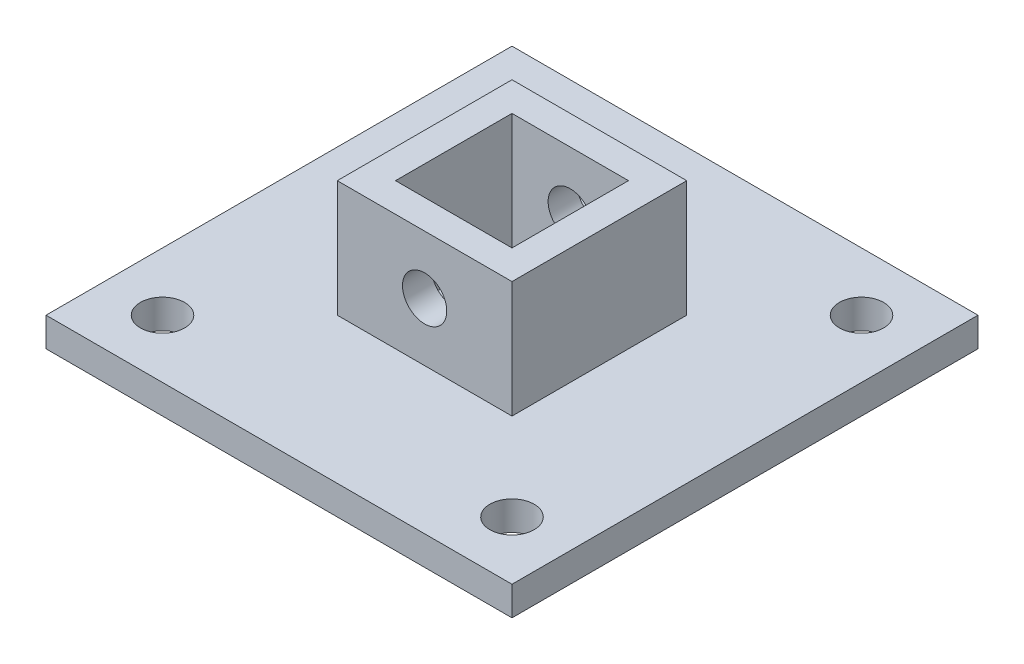
ISO-10303-21;
HEADER;
FILE_DESCRIPTION(('STEP AP214'),'2;1');
FILE_NAME('part.step','',(''),(''),'','','');
FILE_SCHEMA(('AUTOMOTIVE_DESIGN { 1 0 10303 214 1 1 1 1 }'));
ENDSEC;
DATA;
#1=APPLICATION_CONTEXT('core data for automotive mechanical design processes');
#2=APPLICATION_PROTOCOL_DEFINITION('international standard','automotive_design',2000,#1);
#3=PRODUCT_CONTEXT('',#1,'mechanical');
#4=PRODUCT('Part','Part','',(#3));
#5=PRODUCT_RELATED_PRODUCT_CATEGORY('part','',(#4));
#6=PRODUCT_DEFINITION_FORMATION('','',#4);
#7=PRODUCT_DEFINITION_CONTEXT('part definition',#1,'design');
#8=PRODUCT_DEFINITION('design','',#6,#7);
#9=PRODUCT_DEFINITION_SHAPE('','',#8);
#10=(LENGTH_UNIT() NAMED_UNIT(*) SI_UNIT(.MILLI.,.METRE.));
#11=(NAMED_UNIT(*) PLANE_ANGLE_UNIT() SI_UNIT($,.RADIAN.));
#12=(NAMED_UNIT(*) SI_UNIT($,.STERADIAN.) SOLID_ANGLE_UNIT());
#13=UNCERTAINTY_MEASURE_WITH_UNIT(LENGTH_MEASURE(1.E-05),#10,'distance_accuracy_value','');
#14=(GEOMETRIC_REPRESENTATION_CONTEXT(3) GLOBAL_UNCERTAINTY_ASSIGNED_CONTEXT((#13)) GLOBAL_UNIT_ASSIGNED_CONTEXT((#10,
#11,#12)) REPRESENTATION_CONTEXT('',''));
#15=CARTESIAN_POINT('',(0.,0.,0.));
#16=DIRECTION('',(0.,0.,1.));
#17=DIRECTION('',(1.,0.,0.));
#18=AXIS2_PLACEMENT_3D('',#15,#16,#17);
#19=CARTESIAN_POINT('',(0.,6.35,0.));
#20=DIRECTION('',(0.,1.,0.));
#21=DIRECTION('',(0.,0.,1.));
#22=AXIS2_PLACEMENT_3D('',#19,#20,#21);
#23=PLANE('',#22);
#24=CARTESIAN_POINT('',(-38.1,6.35,38.1));
#25=DIRECTION('',(0.,1.,0.));
#26=DIRECTION('',(0.,0.,1.));
#27=AXIS2_PLACEMENT_3D('',#24,#25,#26);
#28=CIRCLE('',#27,4.826);
#29=CARTESIAN_POINT('',(-38.1,6.35,42.926));
#30=VERTEX_POINT('',#29);
#31=EDGE_CURVE('E538',#30,#30,#28,.T.);
#32=ORIENTED_EDGE('',*,*,#31,.F.);
#33=EDGE_LOOP('',(#32));
#34=FACE_BOUND('',#33,.T.);
#35=CARTESIAN_POINT('',(38.1,6.35,38.1));
#36=DIRECTION('',(0.,1.,0.));
#37=DIRECTION('',(0.,0.,1.));
#38=AXIS2_PLACEMENT_3D('',#35,#36,#37);
#39=CIRCLE('',#38,4.826);
#40=CARTESIAN_POINT('',(38.1,6.35,42.926));
#41=VERTEX_POINT('',#40);
#42=EDGE_CURVE('E531',#41,#41,#39,.T.);
#43=ORIENTED_EDGE('',*,*,#42,.F.);
#44=EDGE_LOOP('',(#43));
#45=FACE_BOUND('',#44,.T.);
#46=CARTESIAN_POINT('',(38.1,6.35,-38.1));
#47=DIRECTION('',(0.,1.,0.));
#48=DIRECTION('',(0.,0.,1.));
#49=AXIS2_PLACEMENT_3D('',#46,#47,#48);
#50=CIRCLE('',#49,4.826);
#51=CARTESIAN_POINT('',(38.1,6.35,-33.274));
#52=VERTEX_POINT('',#51);
#53=EDGE_CURVE('E523',#52,#52,#50,.T.);
#54=ORIENTED_EDGE('',*,*,#53,.F.);
#55=EDGE_LOOP('',(#54));
#56=FACE_BOUND('',#55,.T.);
#57=CARTESIAN_POINT('',(-38.1,6.35,-38.1));
#58=DIRECTION('',(0.,1.,0.));
#59=DIRECTION('',(0.,0.,1.));
#60=AXIS2_PLACEMENT_3D('',#57,#58,#59);
#61=CIRCLE('',#60,4.826);
#62=CARTESIAN_POINT('',(-38.1,6.35,-33.274));
#63=VERTEX_POINT('',#62);
#64=EDGE_CURVE('E271',#63,#63,#61,.T.);
#65=ORIENTED_EDGE('',*,*,#64,.F.);
#66=EDGE_LOOP('',(#65));
#67=FACE_BOUND('',#66,.T.);
#68=DIRECTION('',(0.,0.,1.));
#69=VECTOR('',#68,1.);
#70=CARTESIAN_POINT('',(-50.8,6.35,50.8));
#71=LINE('',#70,#69);
#72=CARTESIAN_POINT('',(-50.8,6.35,-50.8));
#73=VERTEX_POINT('',#72);
#74=CARTESIAN_POINT('',(-50.8,6.35,50.8));
#75=VERTEX_POINT('',#74);
#76=EDGE_CURVE('E225',#73,#75,#71,.T.);
#77=ORIENTED_EDGE('',*,*,#76,.T.);
#78=DIRECTION('',(1.,0.,0.));
#79=VECTOR('',#78,1.);
#80=CARTESIAN_POINT('',(50.8,6.35,50.8));
#81=LINE('',#80,#79);
#82=CARTESIAN_POINT('',(50.8,6.35,50.8));
#83=VERTEX_POINT('',#82);
#84=EDGE_CURVE('E229',#75,#83,#81,.T.);
#85=ORIENTED_EDGE('',*,*,#84,.T.);
#86=DIRECTION('',(0.,0.,-1.));
#87=VECTOR('',#86,1.);
#88=CARTESIAN_POINT('',(50.8,6.35,50.8));
#89=LINE('',#88,#87);
#90=CARTESIAN_POINT('',(50.8,6.35,-50.8));
#91=VERTEX_POINT('',#90);
#92=EDGE_CURVE('E233',#83,#91,#89,.T.);
#93=ORIENTED_EDGE('',*,*,#92,.T.);
#94=DIRECTION('',(-1.,0.,0.));
#95=VECTOR('',#94,1.);
#96=CARTESIAN_POINT('',(50.8,6.35,-50.8));
#97=LINE('',#96,#95);
#98=EDGE_CURVE('E236',#91,#73,#97,.T.);
#99=ORIENTED_EDGE('',*,*,#98,.T.);
#100=EDGE_LOOP('',(#77,#85,#93,#99));
#101=FACE_BOUND('',#100,.T.);
#102=DIRECTION('',(-1.,0.,0.));
#103=VECTOR('',#102,1.);
#104=CARTESIAN_POINT('',(-19.05,6.35,-19.05));
#105=LINE('',#104,#103);
#106=CARTESIAN_POINT('',(19.05,6.35,-19.05));
#107=VERTEX_POINT('',#106);
#108=CARTESIAN_POINT('',(-19.05,6.35,-19.05));
#109=VERTEX_POINT('',#108);
#110=EDGE_CURVE('E204',#107,#109,#105,.T.);
#111=ORIENTED_EDGE('',*,*,#110,.F.);
#112=DIRECTION('',(0.,0.,-1.));
#113=VECTOR('',#112,1.);
#114=CARTESIAN_POINT('',(19.05,6.35,19.05));
#115=LINE('',#114,#113);
#116=CARTESIAN_POINT('',(19.05,6.35,19.05));
#117=VERTEX_POINT('',#116);
#118=EDGE_CURVE('E152',#117,#107,#115,.T.);
#119=ORIENTED_EDGE('',*,*,#118,.F.);
#120=DIRECTION('',(1.,0.,0.));
#121=VECTOR('',#120,1.);
#122=CARTESIAN_POINT('',(-19.05,6.35,19.05));
#123=LINE('',#122,#121);
#124=CARTESIAN_POINT('',(-19.05,6.35,19.05));
#125=VERTEX_POINT('',#124);
#126=EDGE_CURVE('E191',#125,#117,#123,.T.);
#127=ORIENTED_EDGE('',*,*,#126,.F.);
#128=DIRECTION('',(0.,0.,1.));
#129=VECTOR('',#128,1.);
#130=CARTESIAN_POINT('',(-19.05,6.35,19.05));
#131=LINE('',#130,#129);
#132=EDGE_CURVE('E207',#109,#125,#131,.T.);
#133=ORIENTED_EDGE('',*,*,#132,.F.);
#134=EDGE_LOOP('',(#111,#119,#127,#133));
#135=FACE_BOUND('',#134,.T.);
#136=ADVANCED_FACE('F39',(#34,#45,#56,#67,#101,#135),#23,.T.);
#137=CARTESIAN_POINT('',(-50.8,6.35,50.8));
#138=DIRECTION('',(1.,0.,0.));
#139=DIRECTION('',(0.,0.,-1.));
#140=AXIS2_PLACEMENT_3D('',#137,#138,#139);
#141=PLANE('',#140);
#142=DIRECTION('',(0.,0.,1.));
#143=VECTOR('',#142,1.);
#144=CARTESIAN_POINT('',(-50.8,0.,50.8));
#145=LINE('',#144,#143);
#146=CARTESIAN_POINT('',(-50.8,0.,-50.8));
#147=VERTEX_POINT('',#146);
#148=CARTESIAN_POINT('',(-50.8,0.,50.8));
#149=VERTEX_POINT('',#148);
#150=EDGE_CURVE('E224',#147,#149,#145,.T.);
#151=ORIENTED_EDGE('',*,*,#150,.T.);
#152=DIRECTION('',(0.,-1.,0.));
#153=VECTOR('',#152,1.);
#154=CARTESIAN_POINT('',(-50.8,6.35,50.8));
#155=LINE('',#154,#153);
#156=EDGE_CURVE('E11',#75,#149,#155,.T.);
#157=ORIENTED_EDGE('',*,*,#156,.F.);
#158=ORIENTED_EDGE('',*,*,#76,.F.);
#159=DIRECTION('',(0.,-1.,0.));
#160=VECTOR('',#159,1.);
#161=CARTESIAN_POINT('',(-50.8,6.35,-50.8));
#162=LINE('',#161,#160);
#163=EDGE_CURVE('E239',#73,#147,#162,.T.);
#164=ORIENTED_EDGE('',*,*,#163,.T.);
#165=EDGE_LOOP('',(#151,#157,#158,#164));
#166=FACE_BOUND('',#165,.T.);
#167=ADVANCED_FACE('F41',(#166),#141,.F.);
#168=CARTESIAN_POINT('',(50.8,6.35,50.8));
#169=DIRECTION('',(0.,0.,-1.));
#170=DIRECTION('',(-1.,0.,0.));
#171=AXIS2_PLACEMENT_3D('',#168,#169,#170);
#172=PLANE('',#171);
#173=DIRECTION('',(1.,0.,0.));
#174=VECTOR('',#173,1.);
#175=CARTESIAN_POINT('',(50.8,0.,50.8));
#176=LINE('',#175,#174);
#177=CARTESIAN_POINT('',(50.8,0.,50.8));
#178=VERTEX_POINT('',#177);
#179=EDGE_CURVE('E243',#149,#178,#176,.T.);
#180=ORIENTED_EDGE('',*,*,#179,.T.);
#181=DIRECTION('',(0.,-1.,0.));
#182=VECTOR('',#181,1.);
#183=CARTESIAN_POINT('',(50.8,6.35,50.8));
#184=LINE('',#183,#182);
#185=EDGE_CURVE('E49',#83,#178,#184,.T.);
#186=ORIENTED_EDGE('',*,*,#185,.F.);
#187=ORIENTED_EDGE('',*,*,#84,.F.);
#188=ORIENTED_EDGE('',*,*,#156,.T.);
#189=EDGE_LOOP('',(#180,#186,#187,#188));
#190=FACE_BOUND('',#189,.T.);
#191=ADVANCED_FACE('F305',(#190),#172,.F.);
#192=CARTESIAN_POINT('',(50.8,6.35,50.8));
#193=DIRECTION('',(-1.,0.,0.));
#194=DIRECTION('',(0.,0.,1.));
#195=AXIS2_PLACEMENT_3D('',#192,#193,#194);
#196=PLANE('',#195);
#197=DIRECTION('',(0.,0.,-1.));
#198=VECTOR('',#197,1.);
#199=CARTESIAN_POINT('',(50.8,0.,50.8));
#200=LINE('',#199,#198);
#201=CARTESIAN_POINT('',(50.8,0.,-50.8));
#202=VERTEX_POINT('',#201);
#203=EDGE_CURVE('E246',#178,#202,#200,.T.);
#204=ORIENTED_EDGE('',*,*,#203,.T.);
#205=DIRECTION('',(0.,-1.,0.));
#206=VECTOR('',#205,1.);
#207=CARTESIAN_POINT('',(50.8,6.35,-50.8));
#208=LINE('',#207,#206);
#209=EDGE_CURVE('E254',#91,#202,#208,.T.);
#210=ORIENTED_EDGE('',*,*,#209,.F.);
#211=ORIENTED_EDGE('',*,*,#92,.F.);
#212=ORIENTED_EDGE('',*,*,#185,.T.);
#213=EDGE_LOOP('',(#204,#210,#211,#212));
#214=FACE_BOUND('',#213,.T.);
#215=ADVANCED_FACE('F439',(#214),#196,.F.);
#216=CARTESIAN_POINT('',(50.8,6.35,-50.8));
#217=DIRECTION('',(0.,0.,1.));
#218=DIRECTION('',(1.,0.,0.));
#219=AXIS2_PLACEMENT_3D('',#216,#217,#218);
#220=PLANE('',#219);
#221=DIRECTION('',(-1.,0.,0.));
#222=VECTOR('',#221,1.);
#223=CARTESIAN_POINT('',(50.8,0.,-50.8));
#224=LINE('',#223,#222);
#225=EDGE_CURVE('E230',#202,#147,#224,.T.);
#226=ORIENTED_EDGE('',*,*,#225,.T.);
#227=ORIENTED_EDGE('',*,*,#163,.F.);
#228=ORIENTED_EDGE('',*,*,#98,.F.);
#229=ORIENTED_EDGE('',*,*,#209,.T.);
#230=EDGE_LOOP('',(#226,#227,#228,#229));
#231=FACE_BOUND('',#230,.T.);
#232=ADVANCED_FACE('F405',(#231),#220,.F.);
#233=CARTESIAN_POINT('',(0.,0.,0.));
#234=DIRECTION('',(0.,1.,0.));
#235=DIRECTION('',(0.,0.,1.));
#236=AXIS2_PLACEMENT_3D('',#233,#234,#235);
#237=PLANE('',#236);
#238=CARTESIAN_POINT('',(-38.1,0.,38.1));
#239=DIRECTION('',(0.,1.,0.));
#240=DIRECTION('',(0.,0.,1.));
#241=AXIS2_PLACEMENT_3D('',#238,#239,#240);
#242=CIRCLE('',#241,4.826);
#243=CARTESIAN_POINT('',(-38.1,0.,42.926));
#244=VERTEX_POINT('',#243);
#245=EDGE_CURVE('E43',#244,#244,#242,.T.);
#246=ORIENTED_EDGE('',*,*,#245,.T.);
#247=EDGE_LOOP('',(#246));
#248=FACE_BOUND('',#247,.T.);
#249=CARTESIAN_POINT('',(38.1,0.,38.1));
#250=DIRECTION('',(0.,1.,0.));
#251=DIRECTION('',(0.,0.,1.));
#252=AXIS2_PLACEMENT_3D('',#249,#250,#251);
#253=CIRCLE('',#252,4.826);
#254=CARTESIAN_POINT('',(38.1,0.,42.926));
#255=VERTEX_POINT('',#254);
#256=EDGE_CURVE('E274',#255,#255,#253,.T.);
#257=ORIENTED_EDGE('',*,*,#256,.T.);
#258=EDGE_LOOP('',(#257));
#259=FACE_BOUND('',#258,.T.);
#260=CARTESIAN_POINT('',(38.1,0.,-38.1));
#261=DIRECTION('',(0.,1.,0.));
#262=DIRECTION('',(0.,0.,1.));
#263=AXIS2_PLACEMENT_3D('',#260,#261,#262);
#264=CIRCLE('',#263,4.826);
#265=CARTESIAN_POINT('',(38.1,0.,-33.274));
#266=VERTEX_POINT('',#265);
#267=EDGE_CURVE('E270',#266,#266,#264,.T.);
#268=ORIENTED_EDGE('',*,*,#267,.T.);
#269=EDGE_LOOP('',(#268));
#270=FACE_BOUND('',#269,.T.);
#271=CARTESIAN_POINT('',(-38.1,0.,-38.1));
#272=DIRECTION('',(0.,1.,0.));
#273=DIRECTION('',(0.,0.,1.));
#274=AXIS2_PLACEMENT_3D('',#271,#272,#273);
#275=CIRCLE('',#274,4.826);
#276=CARTESIAN_POINT('',(-38.1,0.,-33.274));
#277=VERTEX_POINT('',#276);
#278=EDGE_CURVE('E266',#277,#277,#275,.T.);
#279=ORIENTED_EDGE('',*,*,#278,.T.);
#280=EDGE_LOOP('',(#279));
#281=FACE_BOUND('',#280,.T.);
#282=ORIENTED_EDGE('',*,*,#150,.F.);
#283=ORIENTED_EDGE('',*,*,#225,.F.);
#284=ORIENTED_EDGE('',*,*,#203,.F.);
#285=ORIENTED_EDGE('',*,*,#179,.F.);
#286=EDGE_LOOP('',(#282,#283,#284,#285));
#287=FACE_BOUND('',#286,.T.);
#288=ADVANCED_FACE('F283',(#248,#259,#270,#281,#287),#237,.F.);
#289=CARTESIAN_POINT('',(0.,31.75,0.));
#290=DIRECTION('',(0.,-1.,0.));
#291=DIRECTION('',(0.,0.,-1.));
#292=AXIS2_PLACEMENT_3D('',#289,#290,#291);
#293=PLANE('',#292);
#294=DIRECTION('',(0.,0.,-1.));
#295=VECTOR('',#294,1.);
#296=CARTESIAN_POINT('',(19.05,31.75,19.05));
#297=LINE('',#296,#295);
#298=CARTESIAN_POINT('',(19.05,31.75,19.05));
#299=VERTEX_POINT('',#298);
#300=CARTESIAN_POINT('',(19.05,31.75,-19.05));
#301=VERTEX_POINT('',#300);
#302=EDGE_CURVE('E186',#299,#301,#297,.T.);
#303=ORIENTED_EDGE('',*,*,#302,.T.);
#304=DIRECTION('',(-1.,0.,0.));
#305=VECTOR('',#304,1.);
#306=CARTESIAN_POINT('',(-19.05,31.75,-19.05));
#307=LINE('',#306,#305);
#308=CARTESIAN_POINT('',(-19.05,31.75,-19.05));
#309=VERTEX_POINT('',#308);
#310=EDGE_CURVE('E190',#301,#309,#307,.T.);
#311=ORIENTED_EDGE('',*,*,#310,.T.);
#312=DIRECTION('',(0.,0.,1.));
#313=VECTOR('',#312,1.);
#314=CARTESIAN_POINT('',(-19.05,31.75,19.05));
#315=LINE('',#314,#313);
#316=CARTESIAN_POINT('',(-19.05,31.75,19.05));
#317=VERTEX_POINT('',#316);
#318=EDGE_CURVE('E194',#309,#317,#315,.T.);
#319=ORIENTED_EDGE('',*,*,#318,.T.);
#320=DIRECTION('',(1.,0.,0.));
#321=VECTOR('',#320,1.);
#322=CARTESIAN_POINT('',(-19.05,31.75,19.05));
#323=LINE('',#322,#321);
#324=EDGE_CURVE('E197',#317,#299,#323,.T.);
#325=ORIENTED_EDGE('',*,*,#324,.T.);
#326=EDGE_LOOP('',(#303,#311,#319,#325));
#327=FACE_BOUND('',#326,.T.);
#328=DIRECTION('',(0.,0.,1.));
#329=VECTOR('',#328,1.);
#330=CARTESIAN_POINT('',(-12.7,31.75,12.7));
#331=LINE('',#330,#329);
#332=CARTESIAN_POINT('',(-12.7,31.75,-12.7));
#333=VERTEX_POINT('',#332);
#334=CARTESIAN_POINT('',(-12.7,31.75,12.7));
#335=VERTEX_POINT('',#334);
#336=EDGE_CURVE('E133',#333,#335,#331,.T.);
#337=ORIENTED_EDGE('',*,*,#336,.F.);
#338=DIRECTION('',(-1.,0.,0.));
#339=VECTOR('',#338,1.);
#340=CARTESIAN_POINT('',(12.7,31.75,-12.7));
#341=LINE('',#340,#339);
#342=CARTESIAN_POINT('',(12.7,31.75,-12.7));
#343=VERTEX_POINT('',#342);
#344=EDGE_CURVE('E162',#343,#333,#341,.T.);
#345=ORIENTED_EDGE('',*,*,#344,.F.);
#346=DIRECTION('',(0.,0.,-1.));
#347=VECTOR('',#346,1.);
#348=CARTESIAN_POINT('',(12.7,31.75,12.7));
#349=LINE('',#348,#347);
#350=CARTESIAN_POINT('',(12.7,31.75,12.7));
#351=VERTEX_POINT('',#350);
#352=EDGE_CURVE('E158',#351,#343,#349,.T.);
#353=ORIENTED_EDGE('',*,*,#352,.F.);
#354=DIRECTION('',(1.,0.,0.));
#355=VECTOR('',#354,1.);
#356=CARTESIAN_POINT('',(12.7,31.75,12.7));
#357=LINE('',#356,#355);
#358=EDGE_CURVE('E143',#335,#351,#357,.T.);
#359=ORIENTED_EDGE('',*,*,#358,.F.);
#360=EDGE_LOOP('',(#337,#345,#353,#359));
#361=FACE_BOUND('',#360,.T.);
#362=ADVANCED_FACE('F156',(#327,#361),#293,.F.);
#363=CARTESIAN_POINT('',(19.05,31.75,19.05));
#364=DIRECTION('',(-1.,0.,0.));
#365=DIRECTION('',(0.,0.,1.));
#366=AXIS2_PLACEMENT_3D('',#363,#364,#365);
#367=PLANE('',#366);
#368=ORIENTED_EDGE('',*,*,#118,.T.);
#369=DIRECTION('',(0.,-1.,0.));
#370=VECTOR('',#369,1.);
#371=CARTESIAN_POINT('',(19.05,31.75,-19.05));
#372=LINE('',#371,#370);
#373=EDGE_CURVE('E221',#301,#107,#372,.T.);
#374=ORIENTED_EDGE('',*,*,#373,.F.);
#375=ORIENTED_EDGE('',*,*,#302,.F.);
#376=DIRECTION('',(0.,-1.,0.));
#377=VECTOR('',#376,1.);
#378=CARTESIAN_POINT('',(19.05,31.75,19.05));
#379=LINE('',#378,#377);
#380=EDGE_CURVE('E200',#299,#117,#379,.T.);
#381=ORIENTED_EDGE('',*,*,#380,.T.);
#382=EDGE_LOOP('',(#368,#374,#375,#381));
#383=FACE_BOUND('',#382,.T.);
#384=ADVANCED_FACE('F340',(#383),#367,.F.);
#385=CARTESIAN_POINT('',(-19.05,31.75,-19.05));
#386=DIRECTION('',(0.,0.,1.));
#387=DIRECTION('',(1.,0.,0.));
#388=AXIS2_PLACEMENT_3D('',#385,#386,#387);
#389=PLANE('',#388);
#390=CARTESIAN_POINT('',(0.,19.05,-19.05));
#391=DIRECTION('',(0.,0.,1.));
#392=DIRECTION('',(1.,0.,0.));
#393=AXIS2_PLACEMENT_3D('',#390,#391,#392);
#394=CIRCLE('',#393,4.826);
#395=CARTESIAN_POINT('',(4.826,19.05,-19.05));
#396=VERTEX_POINT('',#395);
#397=EDGE_CURVE('E170',#396,#396,#394,.T.);
#398=ORIENTED_EDGE('',*,*,#397,.T.);
#399=EDGE_LOOP('',(#398));
#400=FACE_BOUND('',#399,.T.);
#401=ORIENTED_EDGE('',*,*,#110,.T.);
#402=DIRECTION('',(0.,-1.,0.));
#403=VECTOR('',#402,1.);
#404=CARTESIAN_POINT('',(-19.05,31.75,-19.05));
#405=LINE('',#404,#403);
#406=EDGE_CURVE('E217',#309,#109,#405,.T.);
#407=ORIENTED_EDGE('',*,*,#406,.F.);
#408=ORIENTED_EDGE('',*,*,#310,.F.);
#409=ORIENTED_EDGE('',*,*,#373,.T.);
#410=EDGE_LOOP('',(#401,#407,#408,#409));
#411=FACE_BOUND('',#410,.T.);
#412=ADVANCED_FACE('F348',(#400,#411),#389,.F.);
#413=CARTESIAN_POINT('',(-19.05,31.75,19.05));
#414=DIRECTION('',(1.,0.,0.));
#415=DIRECTION('',(0.,0.,-1.));
#416=AXIS2_PLACEMENT_3D('',#413,#414,#415);
#417=PLANE('',#416);
#418=ORIENTED_EDGE('',*,*,#132,.T.);
#419=DIRECTION('',(0.,-1.,0.));
#420=VECTOR('',#419,1.);
#421=CARTESIAN_POINT('',(-19.05,31.75,19.05));
#422=LINE('',#421,#420);
#423=EDGE_CURVE('E57',#317,#125,#422,.T.);
#424=ORIENTED_EDGE('',*,*,#423,.F.);
#425=ORIENTED_EDGE('',*,*,#318,.F.);
#426=ORIENTED_EDGE('',*,*,#406,.T.);
#427=EDGE_LOOP('',(#418,#424,#425,#426));
#428=FACE_BOUND('',#427,.T.);
#429=ADVANCED_FACE('F344',(#428),#417,.F.);
#430=CARTESIAN_POINT('',(-19.05,31.75,19.05));
#431=DIRECTION('',(0.,0.,-1.));
#432=DIRECTION('',(-1.,0.,0.));
#433=AXIS2_PLACEMENT_3D('',#430,#431,#432);
#434=PLANE('',#433);
#435=CARTESIAN_POINT('',(0.,19.05,19.05));
#436=DIRECTION('',(0.,0.,-1.));
#437=DIRECTION('',(-1.,0.,0.));
#438=AXIS2_PLACEMENT_3D('',#435,#436,#437);
#439=CIRCLE('',#438,4.826);
#440=CARTESIAN_POINT('',(-4.826,19.05,19.05));
#441=VERTEX_POINT('',#440);
#442=EDGE_CURVE('E546',#441,#441,#439,.T.);
#443=ORIENTED_EDGE('',*,*,#442,.T.);
#444=EDGE_LOOP('',(#443));
#445=FACE_BOUND('',#444,.T.);
#446=ORIENTED_EDGE('',*,*,#126,.T.);
#447=ORIENTED_EDGE('',*,*,#380,.F.);
#448=ORIENTED_EDGE('',*,*,#324,.F.);
#449=ORIENTED_EDGE('',*,*,#423,.T.);
#450=EDGE_LOOP('',(#446,#447,#448,#449));
#451=FACE_BOUND('',#450,.T.);
#452=ADVANCED_FACE('F337',(#445,#451),#434,.F.);
#453=CARTESIAN_POINT('',(-12.7,31.75,12.7));
#454=DIRECTION('',(1.,0.,0.));
#455=DIRECTION('',(0.,0.,-1.));
#456=AXIS2_PLACEMENT_3D('',#453,#454,#455);
#457=PLANE('',#456);
#458=DIRECTION('',(0.,0.,1.));
#459=VECTOR('',#458,1.);
#460=CARTESIAN_POINT('',(-12.7,6.35,12.7));
#461=LINE('',#460,#459);
#462=CARTESIAN_POINT('',(-12.7,6.35,-12.7));
#463=VERTEX_POINT('',#462);
#464=CARTESIAN_POINT('',(-12.7,6.35,12.7));
#465=VERTEX_POINT('',#464);
#466=EDGE_CURVE('E65',#463,#465,#461,.T.);
#467=ORIENTED_EDGE('',*,*,#466,.F.);
#468=DIRECTION('',(0.,-1.,0.));
#469=VECTOR('',#468,1.);
#470=CARTESIAN_POINT('',(-12.7,31.75,-12.7));
#471=LINE('',#470,#469);
#472=EDGE_CURVE('E138',#333,#463,#471,.T.);
#473=ORIENTED_EDGE('',*,*,#472,.F.);
#474=ORIENTED_EDGE('',*,*,#336,.T.);
#475=DIRECTION('',(0.,-1.,0.));
#476=VECTOR('',#475,1.);
#477=CARTESIAN_POINT('',(-12.7,31.75,12.7));
#478=LINE('',#477,#476);
#479=EDGE_CURVE('E136',#335,#465,#478,.T.);
#480=ORIENTED_EDGE('',*,*,#479,.T.);
#481=EDGE_LOOP('',(#467,#473,#474,#480));
#482=FACE_BOUND('',#481,.T.);
#483=ADVANCED_FACE('F135',(#482),#457,.T.);
#484=CARTESIAN_POINT('',(12.7,31.75,12.7));
#485=DIRECTION('',(0.,0.,-1.));
#486=DIRECTION('',(-1.,0.,0.));
#487=AXIS2_PLACEMENT_3D('',#484,#485,#486);
#488=PLANE('',#487);
#489=CARTESIAN_POINT('',(0.,19.05,12.7));
#490=DIRECTION('',(0.,0.,-1.));
#491=DIRECTION('',(-1.,0.,0.));
#492=AXIS2_PLACEMENT_3D('',#489,#490,#491);
#493=CIRCLE('',#492,4.826);
#494=CARTESIAN_POINT('',(-4.826,19.05,12.7));
#495=VERTEX_POINT('',#494);
#496=EDGE_CURVE('E265',#495,#495,#493,.T.);
#497=ORIENTED_EDGE('',*,*,#496,.F.);
#498=EDGE_LOOP('',(#497));
#499=FACE_BOUND('',#498,.T.);
#500=DIRECTION('',(1.,0.,0.));
#501=VECTOR('',#500,1.);
#502=CARTESIAN_POINT('',(12.7,6.35,12.7));
#503=LINE('',#502,#501);
#504=CARTESIAN_POINT('',(12.7,6.35,12.7));
#505=VERTEX_POINT('',#504);
#506=EDGE_CURVE('E150',#465,#505,#503,.T.);
#507=ORIENTED_EDGE('',*,*,#506,.F.);
#508=ORIENTED_EDGE('',*,*,#479,.F.);
#509=ORIENTED_EDGE('',*,*,#358,.T.);
#510=DIRECTION('',(0.,-1.,0.));
#511=VECTOR('',#510,1.);
#512=CARTESIAN_POINT('',(12.7,31.75,12.7));
#513=LINE('',#512,#511);
#514=EDGE_CURVE('E153',#351,#505,#513,.T.);
#515=ORIENTED_EDGE('',*,*,#514,.T.);
#516=EDGE_LOOP('',(#507,#508,#509,#515));
#517=FACE_BOUND('',#516,.T.);
#518=ADVANCED_FACE('F147',(#499,#517),#488,.T.);
#519=CARTESIAN_POINT('',(12.7,31.75,12.7));
#520=DIRECTION('',(-1.,0.,0.));
#521=DIRECTION('',(0.,0.,1.));
#522=AXIS2_PLACEMENT_3D('',#519,#520,#521);
#523=PLANE('',#522);
#524=DIRECTION('',(0.,0.,-1.));
#525=VECTOR('',#524,1.);
#526=CARTESIAN_POINT('',(12.7,6.35,12.7));
#527=LINE('',#526,#525);
#528=CARTESIAN_POINT('',(12.7,6.35,-12.7));
#529=VERTEX_POINT('',#528);
#530=EDGE_CURVE('E173',#505,#529,#527,.T.);
#531=ORIENTED_EDGE('',*,*,#530,.F.);
#532=ORIENTED_EDGE('',*,*,#514,.F.);
#533=ORIENTED_EDGE('',*,*,#352,.T.);
#534=DIRECTION('',(0.,-1.,0.));
#535=VECTOR('',#534,1.);
#536=CARTESIAN_POINT('',(12.7,31.75,-12.7));
#537=LINE('',#536,#535);
#538=EDGE_CURVE('E180',#343,#529,#537,.T.);
#539=ORIENTED_EDGE('',*,*,#538,.T.);
#540=EDGE_LOOP('',(#531,#532,#533,#539));
#541=FACE_BOUND('',#540,.T.);
#542=ADVANCED_FACE('F321',(#541),#523,.T.);
#543=CARTESIAN_POINT('',(12.7,31.75,-12.7));
#544=DIRECTION('',(0.,0.,1.));
#545=DIRECTION('',(1.,0.,0.));
#546=AXIS2_PLACEMENT_3D('',#543,#544,#545);
#547=PLANE('',#546);
#548=CARTESIAN_POINT('',(0.,19.05,-12.7));
#549=DIRECTION('',(0.,0.,1.));
#550=DIRECTION('',(1.,0.,0.));
#551=AXIS2_PLACEMENT_3D('',#548,#549,#550);
#552=CIRCLE('',#551,4.826);
#553=CARTESIAN_POINT('',(4.826,19.05,-12.7));
#554=VERTEX_POINT('',#553);
#555=EDGE_CURVE('E261',#554,#554,#552,.T.);
#556=ORIENTED_EDGE('',*,*,#555,.F.);
#557=EDGE_LOOP('',(#556));
#558=FACE_BOUND('',#557,.T.);
#559=DIRECTION('',(-1.,0.,0.));
#560=VECTOR('',#559,1.);
#561=CARTESIAN_POINT('',(12.7,6.35,-12.7));
#562=LINE('',#561,#560);
#563=EDGE_CURVE('E144',#529,#463,#562,.T.);
#564=ORIENTED_EDGE('',*,*,#563,.F.);
#565=ORIENTED_EDGE('',*,*,#538,.F.);
#566=ORIENTED_EDGE('',*,*,#344,.T.);
#567=ORIENTED_EDGE('',*,*,#472,.T.);
#568=EDGE_LOOP('',(#564,#565,#566,#567));
#569=FACE_BOUND('',#568,.T.);
#570=ADVANCED_FACE('F313',(#558,#569),#547,.T.);
#571=ORIENTED_EDGE('',*,*,#466,.T.);
#572=ORIENTED_EDGE('',*,*,#506,.T.);
#573=ORIENTED_EDGE('',*,*,#530,.T.);
#574=ORIENTED_EDGE('',*,*,#563,.T.);
#575=EDGE_LOOP('',(#571,#572,#573,#574));
#576=FACE_BOUND('',#575,.T.);
#577=ADVANCED_FACE('F301',(#576),#23,.T.);
#578=CARTESIAN_POINT('',(0.,19.05,-50.8));
#579=DIRECTION('',(0.,0.,1.));
#580=DIRECTION('',(1.,0.,0.));
#581=AXIS2_PLACEMENT_3D('',#578,#579,#580);
#582=CYLINDRICAL_SURFACE('',#581,4.826);
#583=ORIENTED_EDGE('',*,*,#555,.T.);
#584=EDGE_LOOP('',(#583));
#585=FACE_BOUND('',#584,.T.);
#586=ORIENTED_EDGE('',*,*,#397,.F.);
#587=EDGE_LOOP('',(#586));
#588=FACE_BOUND('',#587,.T.);
#589=ADVANCED_FACE('F312',(#585,#588),#582,.F.);
#590=ORIENTED_EDGE('',*,*,#496,.T.);
#591=EDGE_LOOP('',(#590));
#592=FACE_BOUND('',#591,.T.);
#593=ORIENTED_EDGE('',*,*,#442,.F.);
#594=EDGE_LOOP('',(#593));
#595=FACE_BOUND('',#594,.T.);
#596=ADVANCED_FACE('F318',(#592,#595),#582,.F.);
#597=CARTESIAN_POINT('',(-38.1,-19.05,-38.1));
#598=DIRECTION('',(0.,1.,0.));
#599=DIRECTION('',(0.,0.,1.));
#600=AXIS2_PLACEMENT_3D('',#597,#598,#599);
#601=CYLINDRICAL_SURFACE('',#600,4.826);
#602=ORIENTED_EDGE('',*,*,#64,.T.);
#603=EDGE_LOOP('',(#602));
#604=FACE_BOUND('',#603,.T.);
#605=ORIENTED_EDGE('',*,*,#278,.F.);
#606=EDGE_LOOP('',(#605));
#607=FACE_BOUND('',#606,.T.);
#608=ADVANCED_FACE('F481',(#604,#607),#601,.F.);
#609=CARTESIAN_POINT('',(38.1,-19.05,-38.1));
#610=DIRECTION('',(0.,1.,0.));
#611=DIRECTION('',(0.,0.,1.));
#612=AXIS2_PLACEMENT_3D('',#609,#610,#611);
#613=CYLINDRICAL_SURFACE('',#612,4.826);
#614=ORIENTED_EDGE('',*,*,#53,.T.);
#615=EDGE_LOOP('',(#614));
#616=FACE_BOUND('',#615,.T.);
#617=ORIENTED_EDGE('',*,*,#267,.F.);
#618=EDGE_LOOP('',(#617));
#619=FACE_BOUND('',#618,.T.);
#620=ADVANCED_FACE('F293',(#616,#619),#613,.F.);
#621=CARTESIAN_POINT('',(38.1,-19.05,38.1));
#622=DIRECTION('',(0.,1.,0.));
#623=DIRECTION('',(0.,0.,1.));
#624=AXIS2_PLACEMENT_3D('',#621,#622,#623);
#625=CYLINDRICAL_SURFACE('',#624,4.826);
#626=ORIENTED_EDGE('',*,*,#42,.T.);
#627=EDGE_LOOP('',(#626));
#628=FACE_BOUND('',#627,.T.);
#629=ORIENTED_EDGE('',*,*,#256,.F.);
#630=EDGE_LOOP('',(#629));
#631=FACE_BOUND('',#630,.T.);
#632=ADVANCED_FACE('F287',(#628,#631),#625,.F.);
#633=CARTESIAN_POINT('',(-38.1,-19.05,38.1));
#634=DIRECTION('',(0.,1.,0.));
#635=DIRECTION('',(0.,0.,1.));
#636=AXIS2_PLACEMENT_3D('',#633,#634,#635);
#637=CYLINDRICAL_SURFACE('',#636,4.826);
#638=ORIENTED_EDGE('',*,*,#31,.T.);
#639=EDGE_LOOP('',(#638));
#640=FACE_BOUND('',#639,.T.);
#641=ORIENTED_EDGE('',*,*,#245,.F.);
#642=EDGE_LOOP('',(#641));
#643=FACE_BOUND('',#642,.T.);
#644=ADVANCED_FACE('F285',(#640,#643),#637,.F.);
#645=CLOSED_SHELL('',(#136,#167,#191,#215,#232,#288,#362,#384,#412,#429,#452,#483,#518,#542,
#570,#577,#589,#596,#608,#620,#632,#644));
#646=MANIFOLD_SOLID_BREP('B2',#645);
#647=ADVANCED_BREP_SHAPE_REPRESENTATION('',(#18,#646),#14);
#648=SHAPE_DEFINITION_REPRESENTATION(#9,#647);
ENDSEC;
END-ISO-10303-21;
